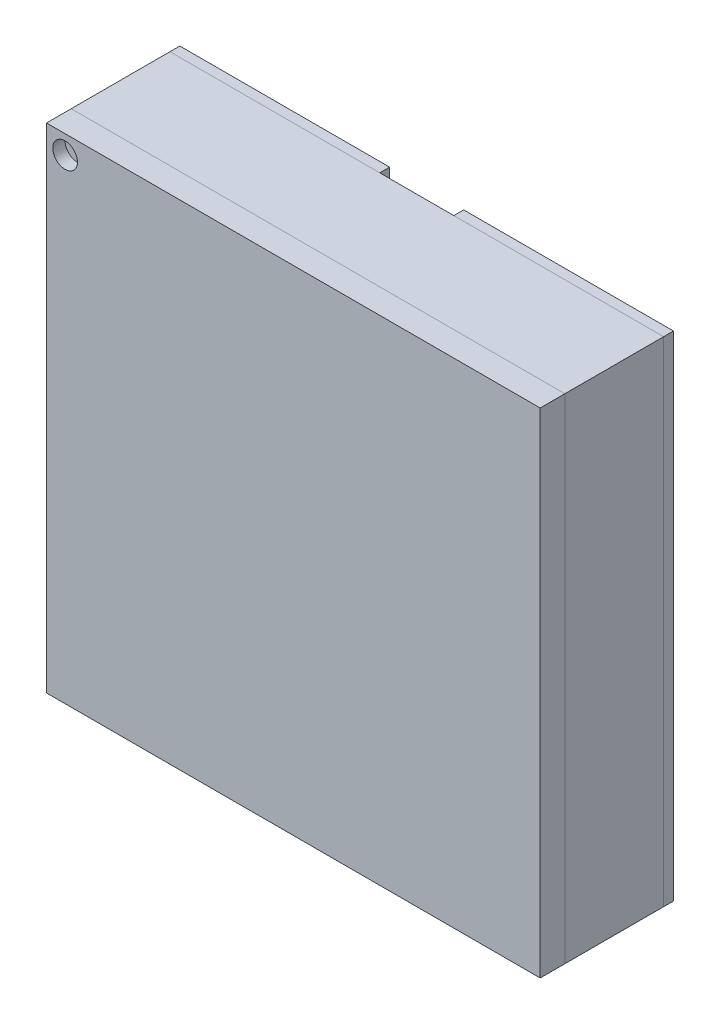
ISO-10303-21;
HEADER;
FILE_DESCRIPTION(('STEP AP214'),'2;1');
FILE_NAME('part.step','',(''),(''),'','','');
FILE_SCHEMA(('AUTOMOTIVE_DESIGN { 1 0 10303 214 1 1 1 1 }'));
ENDSEC;
DATA;
#1=APPLICATION_CONTEXT('core data for automotive mechanical design processes');
#2=APPLICATION_PROTOCOL_DEFINITION('international standard','automotive_design',2000,#1);
#3=PRODUCT_CONTEXT('',#1,'mechanical');
#4=PRODUCT('Part','Part','',(#3));
#5=PRODUCT_RELATED_PRODUCT_CATEGORY('part','',(#4));
#6=PRODUCT_DEFINITION_FORMATION('','',#4);
#7=PRODUCT_DEFINITION_CONTEXT('part definition',#1,'design');
#8=PRODUCT_DEFINITION('design','',#6,#7);
#9=PRODUCT_DEFINITION_SHAPE('','',#8);
#10=(LENGTH_UNIT() NAMED_UNIT(*) SI_UNIT(.MILLI.,.METRE.));
#11=(NAMED_UNIT(*) PLANE_ANGLE_UNIT() SI_UNIT($,.RADIAN.));
#12=(NAMED_UNIT(*) SI_UNIT($,.STERADIAN.) SOLID_ANGLE_UNIT());
#13=UNCERTAINTY_MEASURE_WITH_UNIT(LENGTH_MEASURE(1.E-05),#10,'distance_accuracy_value','');
#14=(GEOMETRIC_REPRESENTATION_CONTEXT(3) GLOBAL_UNCERTAINTY_ASSIGNED_CONTEXT((#13)) GLOBAL_UNIT_ASSIGNED_CONTEXT((#10,
#11,#12)) REPRESENTATION_CONTEXT('',''));
#15=CARTESIAN_POINT('',(0.,0.,0.));
#16=DIRECTION('',(0.,0.,1.));
#17=DIRECTION('',(1.,0.,0.));
#18=AXIS2_PLACEMENT_3D('',#15,#16,#17);
#19=CARTESIAN_POINT('',(11.8549999999791,0.,-0.04));
#20=DIRECTION('',(-1.,0.,0.));
#21=DIRECTION('',(0.,0.,1.));
#22=AXIS2_PLACEMENT_3D('',#19,#20,#21);
#23=PLANE('',#22);
#24=DIRECTION('',(0.,-1.,0.));
#25=VECTOR('',#24,1.);
#26=CARTESIAN_POINT('',(11.8549999999791,0.,0.));
#27=LINE('',#26,#25);
#28=CARTESIAN_POINT('',(11.8549999999791,89.2950000000127,0.));
#29=VERTEX_POINT('',#28);
#30=CARTESIAN_POINT('',(11.8549999999791,87.2950000000127,0.));
#31=VERTEX_POINT('',#30);
#32=EDGE_CURVE('E109',#29,#31,#27,.T.);
#33=ORIENTED_EDGE('',*,*,#32,.F.);
#34=DIRECTION('',(0.,0.,1.));
#35=VECTOR('',#34,1.);
#36=CARTESIAN_POINT('',(11.8549999999791,89.2950000000127,-0.04));
#37=LINE('',#36,#35);
#38=CARTESIAN_POINT('',(11.8549999999791,89.2950000000127,-0.04));
#39=VERTEX_POINT('',#38);
#40=EDGE_CURVE('E12',#39,#29,#37,.T.);
#41=ORIENTED_EDGE('',*,*,#40,.F.);
#42=DIRECTION('',(0.,-1.,0.));
#43=VECTOR('',#42,1.);
#44=CARTESIAN_POINT('',(11.8549999999791,0.,-0.04));
#45=LINE('',#44,#43);
#46=CARTESIAN_POINT('',(11.8549999999791,87.2950000000127,-0.04));
#47=VERTEX_POINT('',#46);
#48=EDGE_CURVE('E97',#39,#47,#45,.T.);
#49=ORIENTED_EDGE('',*,*,#48,.T.);
#50=DIRECTION('',(0.,0.,1.));
#51=VECTOR('',#50,1.);
#52=CARTESIAN_POINT('',(11.8549999999791,87.2950000000127,-0.04));
#53=LINE('',#52,#51);
#54=EDGE_CURVE('E86',#47,#31,#53,.T.);
#55=ORIENTED_EDGE('',*,*,#54,.T.);
#56=EDGE_LOOP('',(#33,#41,#49,#55));
#57=FACE_BOUND('',#56,.T.);
#58=ADVANCED_FACE('F47',(#57),#23,.T.);
#59=CARTESIAN_POINT('',(0.,89.2950000000127,-0.04));
#60=DIRECTION('',(0.,-1.,0.));
#61=DIRECTION('',(0.,0.,-1.));
#62=AXIS2_PLACEMENT_3D('',#59,#60,#61);
#63=PLANE('',#62);
#64=DIRECTION('',(1.,0.,0.));
#65=VECTOR('',#64,1.);
#66=CARTESIAN_POINT('',(0.,89.2950000000127,0.));
#67=LINE('',#66,#65);
#68=CARTESIAN_POINT('',(12.7049999999791,89.2950000000127,0.));
#69=VERTEX_POINT('',#68);
#70=EDGE_CURVE('E102',#29,#69,#67,.T.);
#71=ORIENTED_EDGE('',*,*,#70,.T.);
#72=DIRECTION('',(0.,0.,1.));
#73=VECTOR('',#72,1.);
#74=CARTESIAN_POINT('',(12.7049999999791,89.2950000000127,-0.04));
#75=LINE('',#74,#73);
#76=CARTESIAN_POINT('',(12.7049999999791,89.2950000000127,-0.04));
#77=VERTEX_POINT('',#76);
#78=EDGE_CURVE('E55',#77,#69,#75,.T.);
#79=ORIENTED_EDGE('',*,*,#78,.F.);
#80=DIRECTION('',(1.,0.,0.));
#81=VECTOR('',#80,1.);
#82=CARTESIAN_POINT('',(0.,89.2950000000127,-0.04));
#83=LINE('',#82,#81);
#84=EDGE_CURVE('E92',#39,#77,#83,.T.);
#85=ORIENTED_EDGE('',*,*,#84,.F.);
#86=ORIENTED_EDGE('',*,*,#40,.T.);
#87=EDGE_LOOP('',(#71,#79,#85,#86));
#88=FACE_BOUND('',#87,.T.);
#89=ADVANCED_FACE('F100',(#88),#63,.F.);
#90=CARTESIAN_POINT('',(12.7049999999791,0.,-0.04));
#91=DIRECTION('',(-1.,0.,0.));
#92=DIRECTION('',(0.,0.,1.));
#93=AXIS2_PLACEMENT_3D('',#90,#91,#92);
#94=PLANE('',#93);
#95=DIRECTION('',(0.,-1.,0.));
#96=VECTOR('',#95,1.);
#97=CARTESIAN_POINT('',(12.7049999999791,0.,0.));
#98=LINE('',#97,#96);
#99=CARTESIAN_POINT('',(12.7049999999791,87.2950000000127,0.));
#100=VERTEX_POINT('',#99);
#101=EDGE_CURVE('E79',#69,#100,#98,.T.);
#102=ORIENTED_EDGE('',*,*,#101,.T.);
#103=DIRECTION('',(0.,0.,1.));
#104=VECTOR('',#103,1.);
#105=CARTESIAN_POINT('',(12.7049999999791,87.2950000000127,-0.04));
#106=LINE('',#105,#104);
#107=CARTESIAN_POINT('',(12.7049999999791,87.2950000000127,-0.04));
#108=VERTEX_POINT('',#107);
#109=EDGE_CURVE('E103',#108,#100,#106,.T.);
#110=ORIENTED_EDGE('',*,*,#109,.F.);
#111=DIRECTION('',(0.,-1.,0.));
#112=VECTOR('',#111,1.);
#113=CARTESIAN_POINT('',(12.7049999999791,0.,-0.04));
#114=LINE('',#113,#112);
#115=EDGE_CURVE('E96',#77,#108,#114,.T.);
#116=ORIENTED_EDGE('',*,*,#115,.F.);
#117=ORIENTED_EDGE('',*,*,#78,.T.);
#118=EDGE_LOOP('',(#102,#110,#116,#117));
#119=FACE_BOUND('',#118,.T.);
#120=ADVANCED_FACE('F104',(#119),#94,.F.);
#121=CARTESIAN_POINT('',(0.,87.2950000000127,-0.04));
#122=DIRECTION('',(0.,1.,0.));
#123=DIRECTION('',(0.,0.,1.));
#124=AXIS2_PLACEMENT_3D('',#121,#122,#123);
#125=PLANE('',#124);
#126=DIRECTION('',(-1.,0.,0.));
#127=VECTOR('',#126,1.);
#128=CARTESIAN_POINT('',(0.,87.2950000000127,0.));
#129=LINE('',#128,#127);
#130=EDGE_CURVE('E115',#100,#31,#129,.T.);
#131=ORIENTED_EDGE('',*,*,#130,.T.);
#132=ORIENTED_EDGE('',*,*,#54,.F.);
#133=DIRECTION('',(-1.,0.,0.));
#134=VECTOR('',#133,1.);
#135=CARTESIAN_POINT('',(0.,87.2950000000127,-0.04));
#136=LINE('',#135,#134);
#137=EDGE_CURVE('E63',#108,#47,#136,.T.);
#138=ORIENTED_EDGE('',*,*,#137,.F.);
#139=ORIENTED_EDGE('',*,*,#109,.T.);
#140=EDGE_LOOP('',(#131,#132,#138,#139));
#141=FACE_BOUND('',#140,.T.);
#142=ADVANCED_FACE('F120',(#141),#125,.F.);
#143=CARTESIAN_POINT('',(0.,0.,-0.04));
#144=DIRECTION('',(0.,0.,-1.));
#145=DIRECTION('',(-1.,0.,0.));
#146=AXIS2_PLACEMENT_3D('',#143,#144,#145);
#147=PLANE('',#146);
#148=CARTESIAN_POINT('',(12.2799999999791,88.8950000000127,-0.04));
#149=DIRECTION('',(0.,0.,-1.));
#150=DIRECTION('',(-1.,0.,0.));
#151=AXIS2_PLACEMENT_3D('',#148,#149,#150);
#152=CIRCLE('',#151,0.200000000000002);
#153=CARTESIAN_POINT('',(12.0799999999791,88.8950000000127,-0.04));
#154=VERTEX_POINT('',#153);
#155=EDGE_CURVE('E150',#154,#154,#152,.T.);
#156=ORIENTED_EDGE('',*,*,#155,.F.);
#157=EDGE_LOOP('',(#156));
#158=FACE_BOUND('',#157,.T.);
#159=ORIENTED_EDGE('',*,*,#48,.F.);
#160=ORIENTED_EDGE('',*,*,#84,.T.);
#161=ORIENTED_EDGE('',*,*,#115,.T.);
#162=ORIENTED_EDGE('',*,*,#137,.T.);
#163=EDGE_LOOP('',(#159,#160,#161,#162));
#164=FACE_BOUND('',#163,.T.);
#165=ADVANCED_FACE('F94',(#158,#164),#147,.T.);
#166=CARTESIAN_POINT('',(0.,0.,0.));
#167=DIRECTION('',(0.,0.,-1.));
#168=DIRECTION('',(-1.,0.,0.));
#169=AXIS2_PLACEMENT_3D('',#166,#167,#168);
#170=PLANE('',#169);
#171=ORIENTED_EDGE('',*,*,#32,.T.);
#172=ORIENTED_EDGE('',*,*,#130,.F.);
#173=ORIENTED_EDGE('',*,*,#101,.F.);
#174=ORIENTED_EDGE('',*,*,#70,.F.);
#175=EDGE_LOOP('',(#171,#172,#173,#174));
#176=FACE_BOUND('',#175,.T.);
#177=ADVANCED_FACE('F122',(#176),#170,.F.);
#178=CARTESIAN_POINT('',(12.2799999999791,88.8950000000127,-0.02));
#179=DIRECTION('',(0.,0.,-1.));
#180=DIRECTION('',(-1.,0.,0.));
#181=AXIS2_PLACEMENT_3D('',#178,#179,#180);
#182=CYLINDRICAL_SURFACE('',#181,0.200000000000002);
#183=CARTESIAN_POINT('',(12.2799999999791,88.8950000000127,-0.02));
#184=DIRECTION('',(0.,0.,-1.));
#185=DIRECTION('',(-1.,0.,0.));
#186=AXIS2_PLACEMENT_3D('',#183,#184,#185);
#187=CIRCLE('',#186,0.200000000000002);
#188=CARTESIAN_POINT('',(12.0799999999791,88.8950000000127,-0.02));
#189=VERTEX_POINT('',#188);
#190=EDGE_CURVE('E112',#189,#189,#187,.T.);
#191=ORIENTED_EDGE('',*,*,#190,.F.);
#192=EDGE_LOOP('',(#191));
#193=FACE_BOUND('',#192,.T.);
#194=ORIENTED_EDGE('',*,*,#155,.T.);
#195=EDGE_LOOP('',(#194));
#196=FACE_BOUND('',#195,.T.);
#197=ADVANCED_FACE('F136',(#193,#196),#182,.F.);
#198=CARTESIAN_POINT('',(12.2799999999791,88.8950000000127,-0.02));
#199=DIRECTION('',(0.,0.,-1.));
#200=DIRECTION('',(-1.,0.,0.));
#201=AXIS2_PLACEMENT_3D('',#198,#199,#200);
#202=PLANE('',#201);
#203=ORIENTED_EDGE('',*,*,#190,.T.);
#204=EDGE_LOOP('',(#203));
#205=FACE_BOUND('',#204,.T.);
#206=ADVANCED_FACE('F142',(#205),#202,.T.);
#207=CLOSED_SHELL('',(#58,#89,#120,#142,#165,#177,#197,#206));
#208=MANIFOLD_SOLID_BREP('B2',#207);
#209=CARTESIAN_POINT('',(0.,89.2950000000127,-0.04));
#210=DIRECTION('',(0.,-1.,0.));
#211=DIRECTION('',(0.,0.,-1.));
#212=AXIS2_PLACEMENT_3D('',#209,#210,#211);
#213=PLANE('',#212);
#214=DIRECTION('',(1.,0.,0.));
#215=VECTOR('',#214,1.);
#216=CARTESIAN_POINT('',(0.,89.2950000000127,0.));
#217=LINE('',#216,#215);
#218=CARTESIAN_POINT('',(10.7049999999791,89.2950000000127,0.));
#219=VERTEX_POINT('',#218);
#220=CARTESIAN_POINT('',(11.5549999999791,89.2950000000127,0.));
#221=VERTEX_POINT('',#220);
#222=EDGE_CURVE('E285',#219,#221,#217,.T.);
#223=ORIENTED_EDGE('',*,*,#222,.T.);
#224=DIRECTION('',(0.,0.,1.));
#225=VECTOR('',#224,1.);
#226=CARTESIAN_POINT('',(11.5549999999791,89.2950000000127,-0.04));
#227=LINE('',#226,#225);
#228=CARTESIAN_POINT('',(11.5549999999791,89.2950000000127,-0.04));
#229=VERTEX_POINT('',#228);
#230=EDGE_CURVE('E45',#229,#221,#227,.T.);
#231=ORIENTED_EDGE('',*,*,#230,.F.);
#232=DIRECTION('',(1.,0.,0.));
#233=VECTOR('',#232,1.);
#234=CARTESIAN_POINT('',(0.,89.2950000000127,-0.04));
#235=LINE('',#234,#233);
#236=CARTESIAN_POINT('',(10.7049999999791,89.2950000000127,-0.04));
#237=VERTEX_POINT('',#236);
#238=EDGE_CURVE('E273',#237,#229,#235,.T.);
#239=ORIENTED_EDGE('',*,*,#238,.F.);
#240=DIRECTION('',(0.,0.,1.));
#241=VECTOR('',#240,1.);
#242=CARTESIAN_POINT('',(10.7049999999791,89.2950000000127,-0.04));
#243=LINE('',#242,#241);
#244=EDGE_CURVE('E281',#237,#219,#243,.T.);
#245=ORIENTED_EDGE('',*,*,#244,.T.);
#246=EDGE_LOOP('',(#223,#231,#239,#245));
#247=FACE_BOUND('',#246,.T.);
#248=ADVANCED_FACE('F222',(#247),#213,.F.);
#249=CARTESIAN_POINT('',(11.5549999999791,0.,-0.04));
#250=DIRECTION('',(-1.,0.,0.));
#251=DIRECTION('',(0.,0.,1.));
#252=AXIS2_PLACEMENT_3D('',#249,#250,#251);
#253=PLANE('',#252);
#254=DIRECTION('',(0.,-1.,0.));
#255=VECTOR('',#254,1.);
#256=CARTESIAN_POINT('',(11.5549999999791,0.,0.));
#257=LINE('',#256,#255);
#258=CARTESIAN_POINT('',(11.5549999999791,87.2950000000127,0.));
#259=VERTEX_POINT('',#258);
#260=EDGE_CURVE('E277',#221,#259,#257,.T.);
#261=ORIENTED_EDGE('',*,*,#260,.T.);
#262=DIRECTION('',(0.,0.,1.));
#263=VECTOR('',#262,1.);
#264=CARTESIAN_POINT('',(11.5549999999791,87.2950000000127,-0.04));
#265=LINE('',#264,#263);
#266=CARTESIAN_POINT('',(11.5549999999791,87.2950000000127,-0.04));
#267=VERTEX_POINT('',#266);
#268=EDGE_CURVE('E230',#267,#259,#265,.T.);
#269=ORIENTED_EDGE('',*,*,#268,.F.);
#270=DIRECTION('',(0.,-1.,0.));
#271=VECTOR('',#270,1.);
#272=CARTESIAN_POINT('',(11.5549999999791,0.,-0.04));
#273=LINE('',#272,#271);
#274=EDGE_CURVE('E268',#229,#267,#273,.T.);
#275=ORIENTED_EDGE('',*,*,#274,.F.);
#276=ORIENTED_EDGE('',*,*,#230,.T.);
#277=EDGE_LOOP('',(#261,#269,#275,#276));
#278=FACE_BOUND('',#277,.T.);
#279=ADVANCED_FACE('F276',(#278),#253,.F.);
#280=CARTESIAN_POINT('',(0.,87.2950000000127,-0.04));
#281=DIRECTION('',(0.,1.,0.));
#282=DIRECTION('',(0.,0.,1.));
#283=AXIS2_PLACEMENT_3D('',#280,#281,#282);
#284=PLANE('',#283);
#285=DIRECTION('',(-1.,0.,0.));
#286=VECTOR('',#285,1.);
#287=CARTESIAN_POINT('',(0.,87.2950000000127,0.));
#288=LINE('',#287,#286);
#289=CARTESIAN_POINT('',(10.7049999999791,87.2950000000127,0.));
#290=VERTEX_POINT('',#289);
#291=EDGE_CURVE('E255',#259,#290,#288,.T.);
#292=ORIENTED_EDGE('',*,*,#291,.T.);
#293=DIRECTION('',(0.,0.,1.));
#294=VECTOR('',#293,1.);
#295=CARTESIAN_POINT('',(10.7049999999791,87.2950000000127,-0.04));
#296=LINE('',#295,#294);
#297=CARTESIAN_POINT('',(10.7049999999791,87.2950000000127,-0.04));
#298=VERTEX_POINT('',#297);
#299=EDGE_CURVE('E278',#298,#290,#296,.T.);
#300=ORIENTED_EDGE('',*,*,#299,.F.);
#301=DIRECTION('',(-1.,0.,0.));
#302=VECTOR('',#301,1.);
#303=CARTESIAN_POINT('',(0.,87.2950000000127,-0.04));
#304=LINE('',#303,#302);
#305=EDGE_CURVE('E271',#267,#298,#304,.T.);
#306=ORIENTED_EDGE('',*,*,#305,.F.);
#307=ORIENTED_EDGE('',*,*,#268,.T.);
#308=EDGE_LOOP('',(#292,#300,#306,#307));
#309=FACE_BOUND('',#308,.T.);
#310=ADVANCED_FACE('F279',(#309),#284,.F.);
#311=CARTESIAN_POINT('',(10.7049999999791,0.,-0.04));
#312=DIRECTION('',(1.,0.,0.));
#313=DIRECTION('',(0.,0.,-1.));
#314=AXIS2_PLACEMENT_3D('',#311,#312,#313);
#315=PLANE('',#314);
#316=DIRECTION('',(0.,1.,0.));
#317=VECTOR('',#316,1.);
#318=CARTESIAN_POINT('',(10.7049999999791,0.,0.));
#319=LINE('',#318,#317);
#320=EDGE_CURVE('E261',#290,#219,#319,.T.);
#321=ORIENTED_EDGE('',*,*,#320,.T.);
#322=ORIENTED_EDGE('',*,*,#244,.F.);
#323=DIRECTION('',(0.,1.,0.));
#324=VECTOR('',#323,1.);
#325=CARTESIAN_POINT('',(10.7049999999791,0.,-0.04));
#326=LINE('',#325,#324);
#327=EDGE_CURVE('E238',#298,#237,#326,.T.);
#328=ORIENTED_EDGE('',*,*,#327,.F.);
#329=ORIENTED_EDGE('',*,*,#299,.T.);
#330=EDGE_LOOP('',(#321,#322,#328,#329));
#331=FACE_BOUND('',#330,.T.);
#332=ADVANCED_FACE('F293',(#331),#315,.F.);
#333=CARTESIAN_POINT('',(0.,0.,-0.04));
#334=DIRECTION('',(0.,0.,-1.));
#335=DIRECTION('',(-1.,0.,0.));
#336=AXIS2_PLACEMENT_3D('',#333,#334,#335);
#337=PLANE('',#336);
#338=CARTESIAN_POINT('',(11.1299999999791,88.8950000000127,-0.04));
#339=DIRECTION('',(0.,0.,-1.));
#340=DIRECTION('',(1.,0.,0.));
#341=AXIS2_PLACEMENT_3D('',#338,#339,#340);
#342=CIRCLE('',#341,0.200000000000002);
#343=CARTESIAN_POINT('',(11.3299999999791,88.8950000000127,-0.04));
#344=VERTEX_POINT('',#343);
#345=EDGE_CURVE('E299',#344,#344,#342,.T.);
#346=ORIENTED_EDGE('',*,*,#345,.F.);
#347=EDGE_LOOP('',(#346));
#348=FACE_BOUND('',#347,.T.);
#349=ORIENTED_EDGE('',*,*,#238,.T.);
#350=ORIENTED_EDGE('',*,*,#274,.T.);
#351=ORIENTED_EDGE('',*,*,#305,.T.);
#352=ORIENTED_EDGE('',*,*,#327,.T.);
#353=EDGE_LOOP('',(#349,#350,#351,#352));
#354=FACE_BOUND('',#353,.T.);
#355=ADVANCED_FACE('F269',(#348,#354),#337,.T.);
#356=CARTESIAN_POINT('',(0.,0.,0.));
#357=DIRECTION('',(0.,0.,-1.));
#358=DIRECTION('',(-1.,0.,0.));
#359=AXIS2_PLACEMENT_3D('',#356,#357,#358);
#360=PLANE('',#359);
#361=ORIENTED_EDGE('',*,*,#222,.F.);
#362=ORIENTED_EDGE('',*,*,#320,.F.);
#363=ORIENTED_EDGE('',*,*,#291,.F.);
#364=ORIENTED_EDGE('',*,*,#260,.F.);
#365=EDGE_LOOP('',(#361,#362,#363,#364));
#366=FACE_BOUND('',#365,.T.);
#367=ADVANCED_FACE('F296',(#366),#360,.F.);
#368=CARTESIAN_POINT('',(11.1299999999791,88.8950000000127,-0.02));
#369=DIRECTION('',(0.,0.,-1.));
#370=DIRECTION('',(-1.,0.,0.));
#371=AXIS2_PLACEMENT_3D('',#368,#369,#370);
#372=CYLINDRICAL_SURFACE('',#371,0.200000000000002);
#373=CARTESIAN_POINT('',(11.1299999999791,88.8950000000127,-0.02));
#374=DIRECTION('',(0.,0.,-1.));
#375=DIRECTION('',(1.,0.,0.));
#376=AXIS2_PLACEMENT_3D('',#373,#374,#375);
#377=CIRCLE('',#376,0.200000000000002);
#378=CARTESIAN_POINT('',(11.3299999999791,88.8950000000127,-0.02));
#379=VERTEX_POINT('',#378);
#380=EDGE_CURVE('E288',#379,#379,#377,.T.);
#381=ORIENTED_EDGE('',*,*,#380,.F.);
#382=EDGE_LOOP('',(#381));
#383=FACE_BOUND('',#382,.T.);
#384=ORIENTED_EDGE('',*,*,#345,.T.);
#385=EDGE_LOOP('',(#384));
#386=FACE_BOUND('',#385,.T.);
#387=ADVANCED_FACE('F307',(#383,#386),#372,.F.);
#388=CARTESIAN_POINT('',(11.1299999999791,88.8950000000127,-0.02));
#389=DIRECTION('',(0.,0.,1.));
#390=DIRECTION('',(1.,0.,0.));
#391=AXIS2_PLACEMENT_3D('',#388,#389,#390);
#392=PLANE('',#391);
#393=ORIENTED_EDGE('',*,*,#380,.T.);
#394=EDGE_LOOP('',(#393));
#395=FACE_BOUND('',#394,.T.);
#396=ADVANCED_FACE('F305',(#395),#392,.F.);
#397=CLOSED_SHELL('',(#248,#279,#310,#332,#355,#367,#387,#396));
#398=MANIFOLD_SOLID_BREP('B6',#397);
#399=CARTESIAN_POINT('',(12.7049999999791,89.2950000000127,0.5));
#400=DIRECTION('',(0.,-1.,0.));
#401=DIRECTION('',(0.,0.,-1.));
#402=AXIS2_PLACEMENT_3D('',#399,#400,#401);
#403=PLANE('',#402);
#404=DIRECTION('',(-1.,0.,0.));
#405=VECTOR('',#404,1.);
#406=CARTESIAN_POINT('',(12.7049999999791,89.2950000000127,0.4));
#407=LINE('',#406,#405);
#408=CARTESIAN_POINT('',(12.7049999999791,89.2950000000127,0.4));
#409=VERTEX_POINT('',#408);
#410=CARTESIAN_POINT('',(10.7049999999791,89.2950000000127,0.4));
#411=VERTEX_POINT('',#410);
#412=EDGE_CURVE('E459',#409,#411,#407,.T.);
#413=ORIENTED_EDGE('',*,*,#412,.T.);
#414=DIRECTION('',(0.,0.,-1.));
#415=VECTOR('',#414,1.);
#416=CARTESIAN_POINT('',(10.7049999999791,89.2950000000127,0.5));
#417=LINE('',#416,#415);
#418=CARTESIAN_POINT('',(10.7049999999791,89.2950000000127,0.5));
#419=VERTEX_POINT('',#418);
#420=EDGE_CURVE('E220',#419,#411,#417,.T.);
#421=ORIENTED_EDGE('',*,*,#420,.F.);
#422=DIRECTION('',(-1.,0.,0.));
#423=VECTOR('',#422,1.);
#424=CARTESIAN_POINT('',(12.7049999999791,89.2950000000127,0.5));
#425=LINE('',#424,#423);
#426=CARTESIAN_POINT('',(12.7049999999791,89.2950000000127,0.5));
#427=VERTEX_POINT('',#426);
#428=EDGE_CURVE('E447',#427,#419,#425,.T.);
#429=ORIENTED_EDGE('',*,*,#428,.F.);
#430=DIRECTION('',(0.,0.,-1.));
#431=VECTOR('',#430,1.);
#432=CARTESIAN_POINT('',(12.7049999999791,89.2950000000127,0.5));
#433=LINE('',#432,#431);
#434=EDGE_CURVE('E455',#427,#409,#433,.T.);
#435=ORIENTED_EDGE('',*,*,#434,.T.);
#436=EDGE_LOOP('',(#413,#421,#429,#435));
#437=FACE_BOUND('',#436,.T.);
#438=ADVANCED_FACE('F396',(#437),#403,.F.);
#439=CARTESIAN_POINT('',(10.7049999999791,89.2950000000127,0.5));
#440=DIRECTION('',(1.,0.,0.));
#441=DIRECTION('',(0.,0.,-1.));
#442=AXIS2_PLACEMENT_3D('',#439,#440,#441);
#443=PLANE('',#442);
#444=DIRECTION('',(0.,-1.,0.));
#445=VECTOR('',#444,1.);
#446=CARTESIAN_POINT('',(10.7049999999791,89.2950000000127,0.4));
#447=LINE('',#446,#445);
#448=CARTESIAN_POINT('',(10.7049999999791,87.2950000000127,0.4));
#449=VERTEX_POINT('',#448);
#450=EDGE_CURVE('E451',#411,#449,#447,.T.);
#451=ORIENTED_EDGE('',*,*,#450,.T.);
#452=DIRECTION('',(0.,0.,-1.));
#453=VECTOR('',#452,1.);
#454=CARTESIAN_POINT('',(10.7049999999791,87.2950000000127,0.5));
#455=LINE('',#454,#453);
#456=CARTESIAN_POINT('',(10.7049999999791,87.2950000000127,0.5));
#457=VERTEX_POINT('',#456);
#458=EDGE_CURVE('E404',#457,#449,#455,.T.);
#459=ORIENTED_EDGE('',*,*,#458,.F.);
#460=DIRECTION('',(0.,-1.,0.));
#461=VECTOR('',#460,1.);
#462=CARTESIAN_POINT('',(10.7049999999791,89.2950000000127,0.5));
#463=LINE('',#462,#461);
#464=EDGE_CURVE('E442',#419,#457,#463,.T.);
#465=ORIENTED_EDGE('',*,*,#464,.F.);
#466=ORIENTED_EDGE('',*,*,#420,.T.);
#467=EDGE_LOOP('',(#451,#459,#465,#466));
#468=FACE_BOUND('',#467,.T.);
#469=ADVANCED_FACE('F450',(#468),#443,.F.);
#470=CARTESIAN_POINT('',(10.7049999999791,87.2950000000127,0.5));
#471=DIRECTION('',(0.,1.,0.));
#472=DIRECTION('',(0.,0.,1.));
#473=AXIS2_PLACEMENT_3D('',#470,#471,#472);
#474=PLANE('',#473);
#475=DIRECTION('',(1.,0.,0.));
#476=VECTOR('',#475,1.);
#477=CARTESIAN_POINT('',(10.7049999999791,87.2950000000127,0.4));
#478=LINE('',#477,#476);
#479=CARTESIAN_POINT('',(12.7049999999791,87.2950000000127,0.4));
#480=VERTEX_POINT('',#479);
#481=EDGE_CURVE('E429',#449,#480,#478,.T.);
#482=ORIENTED_EDGE('',*,*,#481,.T.);
#483=DIRECTION('',(0.,0.,-1.));
#484=VECTOR('',#483,1.);
#485=CARTESIAN_POINT('',(12.7049999999791,87.2950000000127,0.5));
#486=LINE('',#485,#484);
#487=CARTESIAN_POINT('',(12.7049999999791,87.2950000000127,0.5));
#488=VERTEX_POINT('',#487);
#489=EDGE_CURVE('E452',#488,#480,#486,.T.);
#490=ORIENTED_EDGE('',*,*,#489,.F.);
#491=DIRECTION('',(1.,0.,0.));
#492=VECTOR('',#491,1.);
#493=CARTESIAN_POINT('',(10.7049999999791,87.2950000000127,0.5));
#494=LINE('',#493,#492);
#495=EDGE_CURVE('E445',#457,#488,#494,.T.);
#496=ORIENTED_EDGE('',*,*,#495,.F.);
#497=ORIENTED_EDGE('',*,*,#458,.T.);
#498=EDGE_LOOP('',(#482,#490,#496,#497));
#499=FACE_BOUND('',#498,.T.);
#500=ADVANCED_FACE('F453',(#499),#474,.F.);
#501=CARTESIAN_POINT('',(12.7049999999791,87.2950000000127,0.5));
#502=DIRECTION('',(-1.,0.,0.));
#503=DIRECTION('',(0.,0.,1.));
#504=AXIS2_PLACEMENT_3D('',#501,#502,#503);
#505=PLANE('',#504);
#506=DIRECTION('',(0.,1.,0.));
#507=VECTOR('',#506,1.);
#508=CARTESIAN_POINT('',(12.7049999999791,87.2950000000127,0.4));
#509=LINE('',#508,#507);
#510=EDGE_CURVE('E435',#480,#409,#509,.T.);
#511=ORIENTED_EDGE('',*,*,#510,.T.);
#512=ORIENTED_EDGE('',*,*,#434,.F.);
#513=DIRECTION('',(0.,1.,0.));
#514=VECTOR('',#513,1.);
#515=CARTESIAN_POINT('',(12.7049999999791,87.2950000000127,0.5));
#516=LINE('',#515,#514);
#517=EDGE_CURVE('E412',#488,#427,#516,.T.);
#518=ORIENTED_EDGE('',*,*,#517,.F.);
#519=ORIENTED_EDGE('',*,*,#489,.T.);
#520=EDGE_LOOP('',(#511,#512,#518,#519));
#521=FACE_BOUND('',#520,.T.);
#522=ADVANCED_FACE('F467',(#521),#505,.F.);
#523=CARTESIAN_POINT('',(0.,0.,0.5));
#524=DIRECTION('',(0.,0.,1.));
#525=DIRECTION('',(1.,0.,0.));
#526=AXIS2_PLACEMENT_3D('',#523,#524,#525);
#527=PLANE('',#526);
#528=CARTESIAN_POINT('',(10.7802990213378,89.219700978654,0.5));
#529=DIRECTION('',(0.,0.,1.));
#530=DIRECTION('',(1.,0.,0.));
#531=AXIS2_PLACEMENT_3D('',#528,#529,#530);
#532=CIRCLE('',#531,0.0499999999999973);
#533=CARTESIAN_POINT('',(10.8302990213378,89.219700978654,0.5));
#534=VERTEX_POINT('',#533);
#535=EDGE_CURVE('E473',#534,#534,#532,.T.);
#536=ORIENTED_EDGE('',*,*,#535,.F.);
#537=EDGE_LOOP('',(#536));
#538=FACE_BOUND('',#537,.T.);
#539=ORIENTED_EDGE('',*,*,#428,.T.);
#540=ORIENTED_EDGE('',*,*,#464,.T.);
#541=ORIENTED_EDGE('',*,*,#495,.T.);
#542=ORIENTED_EDGE('',*,*,#517,.T.);
#543=EDGE_LOOP('',(#539,#540,#541,#542));
#544=FACE_BOUND('',#543,.T.);
#545=ADVANCED_FACE('F443',(#538,#544),#527,.T.);
#546=CARTESIAN_POINT('',(0.,0.,0.4));
#547=DIRECTION('',(0.,0.,1.));
#548=DIRECTION('',(1.,0.,0.));
#549=AXIS2_PLACEMENT_3D('',#546,#547,#548);
#550=PLANE('',#549);
#551=ORIENTED_EDGE('',*,*,#412,.F.);
#552=ORIENTED_EDGE('',*,*,#510,.F.);
#553=ORIENTED_EDGE('',*,*,#481,.F.);
#554=ORIENTED_EDGE('',*,*,#450,.F.);
#555=EDGE_LOOP('',(#551,#552,#553,#554));
#556=FACE_BOUND('',#555,.T.);
#557=ADVANCED_FACE('F470',(#556),#550,.F.);
#558=CARTESIAN_POINT('',(10.7802990213378,89.219700978654,0.45));
#559=DIRECTION('',(0.,0.,1.));
#560=DIRECTION('',(1.,0.,0.));
#561=AXIS2_PLACEMENT_3D('',#558,#559,#560);
#562=CYLINDRICAL_SURFACE('',#561,0.0499999999999973);
#563=CARTESIAN_POINT('',(10.7802990213378,89.219700978654,0.45));
#564=DIRECTION('',(0.,0.,1.));
#565=DIRECTION('',(1.,0.,0.));
#566=AXIS2_PLACEMENT_3D('',#563,#564,#565);
#567=CIRCLE('',#566,0.0499999999999973);
#568=CARTESIAN_POINT('',(10.8302990213378,89.219700978654,0.45));
#569=VERTEX_POINT('',#568);
#570=EDGE_CURVE('E462',#569,#569,#567,.T.);
#571=ORIENTED_EDGE('',*,*,#570,.F.);
#572=EDGE_LOOP('',(#571));
#573=FACE_BOUND('',#572,.T.);
#574=ORIENTED_EDGE('',*,*,#535,.T.);
#575=EDGE_LOOP('',(#574));
#576=FACE_BOUND('',#575,.T.);
#577=ADVANCED_FACE('F481',(#573,#576),#562,.F.);
#578=CARTESIAN_POINT('',(10.7802990213378,89.219700978654,0.45));
#579=DIRECTION('',(0.,0.,1.));
#580=DIRECTION('',(1.,0.,0.));
#581=AXIS2_PLACEMENT_3D('',#578,#579,#580);
#582=PLANE('',#581);
#583=ORIENTED_EDGE('',*,*,#570,.T.);
#584=EDGE_LOOP('',(#583));
#585=FACE_BOUND('',#584,.T.);
#586=ADVANCED_FACE('F479',(#585),#582,.T.);
#587=CLOSED_SHELL('',(#438,#469,#500,#522,#545,#557,#577,#586));
#588=MANIFOLD_SOLID_BREP('B39',#587);
#589=CARTESIAN_POINT('',(10.7049999999791,87.2950000000127,0.4));
#590=DIRECTION('',(1.,0.,0.));
#591=DIRECTION('',(0.,0.,-1.));
#592=AXIS2_PLACEMENT_3D('',#589,#590,#591);
#593=PLANE('',#592);
#594=DIRECTION('',(0.,-1.,0.));
#595=VECTOR('',#594,1.);
#596=CARTESIAN_POINT('',(10.7049999999791,87.2950000000127,0.));
#597=LINE('',#596,#595);
#598=CARTESIAN_POINT('',(10.7049999999791,89.2950000000127,0.));
#599=VERTEX_POINT('',#598);
#600=CARTESIAN_POINT('',(10.7049999999791,87.2950000000127,0.));
#601=VERTEX_POINT('',#600);
#602=EDGE_CURVE('E612',#599,#601,#597,.T.);
#603=ORIENTED_EDGE('',*,*,#602,.T.);
#604=DIRECTION('',(0.,0.,-1.));
#605=VECTOR('',#604,1.);
#606=CARTESIAN_POINT('',(10.7049999999791,87.2950000000127,0.4));
#607=LINE('',#606,#605);
#608=CARTESIAN_POINT('',(10.7049999999791,87.2950000000127,0.4));
#609=VERTEX_POINT('',#608);
#610=EDGE_CURVE('E394',#609,#601,#607,.T.);
#611=ORIENTED_EDGE('',*,*,#610,.F.);
#612=DIRECTION('',(0.,-1.,0.));
#613=VECTOR('',#612,1.);
#614=CARTESIAN_POINT('',(10.7049999999791,87.2950000000127,0.4));
#615=LINE('',#614,#613);
#616=CARTESIAN_POINT('',(10.7049999999791,89.2950000000127,0.4));
#617=VERTEX_POINT('',#616);
#618=EDGE_CURVE('E600',#617,#609,#615,.T.);
#619=ORIENTED_EDGE('',*,*,#618,.F.);
#620=DIRECTION('',(0.,0.,-1.));
#621=VECTOR('',#620,1.);
#622=CARTESIAN_POINT('',(10.7049999999791,89.2950000000127,0.4));
#623=LINE('',#622,#621);
#624=EDGE_CURVE('E608',#617,#599,#623,.T.);
#625=ORIENTED_EDGE('',*,*,#624,.T.);
#626=EDGE_LOOP('',(#603,#611,#619,#625));
#627=FACE_BOUND('',#626,.T.);
#628=ADVANCED_FACE('F549',(#627),#593,.F.);
#629=CARTESIAN_POINT('',(12.7049999999791,87.2950000000127,0.4));
#630=DIRECTION('',(0.,1.,0.));
#631=DIRECTION('',(0.,0.,1.));
#632=AXIS2_PLACEMENT_3D('',#629,#630,#631);
#633=PLANE('',#632);
#634=DIRECTION('',(1.,0.,0.));
#635=VECTOR('',#634,1.);
#636=CARTESIAN_POINT('',(12.7049999999791,87.2950000000127,0.));
#637=LINE('',#636,#635);
#638=CARTESIAN_POINT('',(12.7049999999791,87.2950000000127,0.));
#639=VERTEX_POINT('',#638);
#640=EDGE_CURVE('E604',#601,#639,#637,.T.);
#641=ORIENTED_EDGE('',*,*,#640,.T.);
#642=DIRECTION('',(0.,0.,-1.));
#643=VECTOR('',#642,1.);
#644=CARTESIAN_POINT('',(12.7049999999791,87.2950000000127,0.4));
#645=LINE('',#644,#643);
#646=CARTESIAN_POINT('',(12.7049999999791,87.2950000000127,0.4));
#647=VERTEX_POINT('',#646);
#648=EDGE_CURVE('E557',#647,#639,#645,.T.);
#649=ORIENTED_EDGE('',*,*,#648,.F.);
#650=DIRECTION('',(1.,0.,0.));
#651=VECTOR('',#650,1.);
#652=CARTESIAN_POINT('',(12.7049999999791,87.2950000000127,0.4));
#653=LINE('',#652,#651);
#654=EDGE_CURVE('E595',#609,#647,#653,.T.);
#655=ORIENTED_EDGE('',*,*,#654,.F.);
#656=ORIENTED_EDGE('',*,*,#610,.T.);
#657=EDGE_LOOP('',(#641,#649,#655,#656));
#658=FACE_BOUND('',#657,.T.);
#659=ADVANCED_FACE('F603',(#658),#633,.F.);
#660=CARTESIAN_POINT('',(12.7049999999791,89.2950000000127,0.4));
#661=DIRECTION('',(-1.,0.,0.));
#662=DIRECTION('',(0.,0.,1.));
#663=AXIS2_PLACEMENT_3D('',#660,#661,#662);
#664=PLANE('',#663);
#665=DIRECTION('',(0.,1.,0.));
#666=VECTOR('',#665,1.);
#667=CARTESIAN_POINT('',(12.7049999999791,89.2950000000127,0.));
#668=LINE('',#667,#666);
#669=CARTESIAN_POINT('',(12.7049999999791,89.2950000000127,0.));
#670=VERTEX_POINT('',#669);
#671=EDGE_CURVE('E582',#639,#670,#668,.T.);
#672=ORIENTED_EDGE('',*,*,#671,.T.);
#673=DIRECTION('',(0.,0.,-1.));
#674=VECTOR('',#673,1.);
#675=CARTESIAN_POINT('',(12.7049999999791,89.2950000000127,0.4));
#676=LINE('',#675,#674);
#677=CARTESIAN_POINT('',(12.7049999999791,89.2950000000127,0.4));
#678=VERTEX_POINT('',#677);
#679=EDGE_CURVE('E605',#678,#670,#676,.T.);
#680=ORIENTED_EDGE('',*,*,#679,.F.);
#681=DIRECTION('',(0.,1.,0.));
#682=VECTOR('',#681,1.);
#683=CARTESIAN_POINT('',(12.7049999999791,89.2950000000127,0.4));
#684=LINE('',#683,#682);
#685=EDGE_CURVE('E598',#647,#678,#684,.T.);
#686=ORIENTED_EDGE('',*,*,#685,.F.);
#687=ORIENTED_EDGE('',*,*,#648,.T.);
#688=EDGE_LOOP('',(#672,#680,#686,#687));
#689=FACE_BOUND('',#688,.T.);
#690=ADVANCED_FACE('F606',(#689),#664,.F.);
#691=CARTESIAN_POINT('',(10.7049999999791,89.2950000000127,0.4));
#692=DIRECTION('',(0.,-1.,0.));
#693=DIRECTION('',(0.,0.,-1.));
#694=AXIS2_PLACEMENT_3D('',#691,#692,#693);
#695=PLANE('',#694);
#696=DIRECTION('',(-1.,0.,0.));
#697=VECTOR('',#696,1.);
#698=CARTESIAN_POINT('',(10.7049999999791,89.2950000000127,0.));
#699=LINE('',#698,#697);
#700=EDGE_CURVE('E588',#670,#599,#699,.T.);
#701=ORIENTED_EDGE('',*,*,#700,.T.);
#702=ORIENTED_EDGE('',*,*,#624,.F.);
#703=DIRECTION('',(-1.,0.,0.));
#704=VECTOR('',#703,1.);
#705=CARTESIAN_POINT('',(10.7049999999791,89.2950000000127,0.4));
#706=LINE('',#705,#704);
#707=EDGE_CURVE('E565',#678,#617,#706,.T.);
#708=ORIENTED_EDGE('',*,*,#707,.F.);
#709=ORIENTED_EDGE('',*,*,#679,.T.);
#710=EDGE_LOOP('',(#701,#702,#708,#709));
#711=FACE_BOUND('',#710,.T.);
#712=ADVANCED_FACE('F619',(#711),#695,.F.);
#713=CARTESIAN_POINT('',(0.,0.,0.4));
#714=DIRECTION('',(0.,0.,-1.));
#715=DIRECTION('',(-1.,0.,0.));
#716=AXIS2_PLACEMENT_3D('',#713,#714,#715);
#717=PLANE('',#716);
#718=ORIENTED_EDGE('',*,*,#618,.T.);
#719=ORIENTED_EDGE('',*,*,#654,.T.);
#720=ORIENTED_EDGE('',*,*,#685,.T.);
#721=ORIENTED_EDGE('',*,*,#707,.T.);
#722=EDGE_LOOP('',(#718,#719,#720,#721));
#723=FACE_BOUND('',#722,.T.);
#724=ADVANCED_FACE('F596',(#723),#717,.F.);
#725=CARTESIAN_POINT('',(0.,0.,0.));
#726=DIRECTION('',(0.,0.,-1.));
#727=DIRECTION('',(-1.,0.,0.));
#728=AXIS2_PLACEMENT_3D('',#725,#726,#727);
#729=PLANE('',#728);
#730=ORIENTED_EDGE('',*,*,#602,.F.);
#731=ORIENTED_EDGE('',*,*,#700,.F.);
#732=ORIENTED_EDGE('',*,*,#671,.F.);
#733=ORIENTED_EDGE('',*,*,#640,.F.);
#734=EDGE_LOOP('',(#730,#731,#732,#733));
#735=FACE_BOUND('',#734,.T.);
#736=ADVANCED_FACE('F622',(#735),#729,.T.);
#737=CLOSED_SHELL('',(#628,#659,#690,#712,#724,#736));
#738=MANIFOLD_SOLID_BREP('B214',#737);
#739=ADVANCED_BREP_SHAPE_REPRESENTATION('',(#18,#208,#398,#588,#738),#14);
#740=SHAPE_DEFINITION_REPRESENTATION(#9,#739);
ENDSEC;
END-ISO-10303-21;
